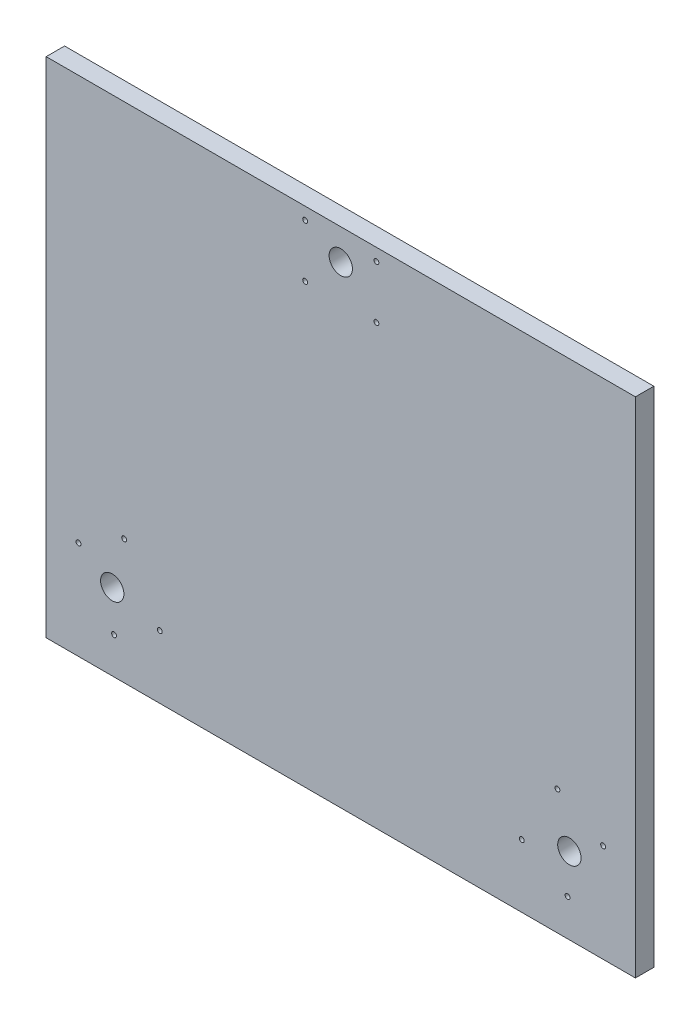
ISO-10303-21;
HEADER;
FILE_DESCRIPTION(('STEP AP214'),'2;1');
FILE_NAME('part.step','',(''),(''),'','','');
FILE_SCHEMA(('AUTOMOTIVE_DESIGN { 1 0 10303 214 1 1 1 1 }'));
ENDSEC;
DATA;
#1=APPLICATION_CONTEXT('core data for automotive mechanical design processes');
#2=APPLICATION_PROTOCOL_DEFINITION('international standard','automotive_design',2000,#1);
#3=PRODUCT_CONTEXT('',#1,'mechanical');
#4=PRODUCT('Part','Part','',(#3));
#5=PRODUCT_RELATED_PRODUCT_CATEGORY('part','',(#4));
#6=PRODUCT_DEFINITION_FORMATION('','',#4);
#7=PRODUCT_DEFINITION_CONTEXT('part definition',#1,'design');
#8=PRODUCT_DEFINITION('design','',#6,#7);
#9=PRODUCT_DEFINITION_SHAPE('','',#8);
#10=(LENGTH_UNIT() NAMED_UNIT(*) SI_UNIT(.MILLI.,.METRE.));
#11=(NAMED_UNIT(*) PLANE_ANGLE_UNIT() SI_UNIT($,.RADIAN.));
#12=(NAMED_UNIT(*) SI_UNIT($,.STERADIAN.) SOLID_ANGLE_UNIT());
#13=UNCERTAINTY_MEASURE_WITH_UNIT(LENGTH_MEASURE(1.E-05),#10,'distance_accuracy_value','');
#14=(GEOMETRIC_REPRESENTATION_CONTEXT(3) GLOBAL_UNCERTAINTY_ASSIGNED_CONTEXT((#13)) GLOBAL_UNIT_ASSIGNED_CONTEXT((#10,
#11,#12)) REPRESENTATION_CONTEXT('',''));
#15=CARTESIAN_POINT('',(0.,0.,0.));
#16=DIRECTION('',(0.,0.,1.));
#17=DIRECTION('',(1.,0.,0.));
#18=AXIS2_PLACEMENT_3D('',#15,#16,#17);
#19=CARTESIAN_POINT('',(0.,0.,15.));
#20=DIRECTION('',(0.,0.,-1.));
#21=DIRECTION('',(-1.,0.,0.));
#22=AXIS2_PLACEMENT_3D('',#19,#20,#21);
#23=PLANE('',#22);
#24=CARTESIAN_POINT('',(147.446750507691,-118.614736709748,15.));
#25=DIRECTION('',(0.,0.,1.));
#26=DIRECTION('',(-0.866025403784442,0.499999999999995,0.));
#27=AXIS2_PLACEMENT_3D('',#24,#25,#26);
#28=CIRCLE('',#27,2.);
#29=CARTESIAN_POINT('',(145.714699700122,-117.614736709748,15.));
#30=VERTEX_POINT('',#29);
#31=EDGE_CURVE('E224',#30,#30,#28,.T.);
#32=ORIENTED_EDGE('',*,*,#31,.F.);
#33=EDGE_LOOP('',(#32));
#34=FACE_BOUND('',#33,.T.);
#35=CARTESIAN_POINT('',(184.685842870422,-140.114736709748,15.));
#36=DIRECTION('',(0.,0.,1.));
#37=DIRECTION('',(-0.866025403784442,0.499999999999995,0.));
#38=AXIS2_PLACEMENT_3D('',#35,#36,#37);
#39=CIRCLE('',#38,2.);
#40=CARTESIAN_POINT('',(182.953792062853,-139.114736709748,15.));
#41=VERTEX_POINT('',#40);
#42=EDGE_CURVE('E218',#41,#41,#39,.T.);
#43=ORIENTED_EDGE('',*,*,#42,.F.);
#44=EDGE_LOOP('',(#43));
#45=FACE_BOUND('',#44,.T.);
#46=CARTESIAN_POINT('',(186.195461813655,-107.499999999999,15.));
#47=DIRECTION('',(0.,0.,1.));
#48=DIRECTION('',(-0.866025403784442,0.499999999999995,0.));
#49=AXIS2_PLACEMENT_3D('',#46,#47,#48);
#50=CIRCLE('',#49,9.50000000000001);
#51=CARTESIAN_POINT('',(177.968220477703,-102.749999999999,15.));
#52=VERTEX_POINT('',#51);
#53=EDGE_CURVE('E209',#52,#52,#50,.T.);
#54=ORIENTED_EDGE('',*,*,#53,.F.);
#55=EDGE_LOOP('',(#54));
#56=FACE_BOUND('',#55,.T.);
#57=CARTESIAN_POINT('',(176.44675050769,-68.3852632902502,15.));
#58=DIRECTION('',(0.,0.,-1.));
#59=DIRECTION('',(0.866025403784442,-0.499999999999995,0.));
#60=AXIS2_PLACEMENT_3D('',#57,#58,#59);
#61=CIRCLE('',#60,2.);
#62=CARTESIAN_POINT('',(178.178801315259,-69.3852632902502,15.));
#63=VERTEX_POINT('',#62);
#64=EDGE_CURVE('E196',#63,#63,#61,.T.);
#65=ORIENTED_EDGE('',*,*,#64,.T.);
#66=EDGE_LOOP('',(#65));
#67=FACE_BOUND('',#66,.T.);
#68=CARTESIAN_POINT('',(-176.44675050769,-68.3852632902515,15.));
#69=DIRECTION('',(0.,0.,1.));
#70=DIRECTION('',(0.866025403784438,0.500000000000001,0.));
#71=AXIS2_PLACEMENT_3D('',#68,#69,#70);
#72=CIRCLE('',#71,2.);
#73=CARTESIAN_POINT('',(-174.714699700121,-67.3852632902515,15.));
#74=VERTEX_POINT('',#73);
#75=EDGE_CURVE('E190',#74,#74,#72,.T.);
#76=ORIENTED_EDGE('',*,*,#75,.F.);
#77=EDGE_LOOP('',(#76));
#78=FACE_BOUND('',#77,.T.);
#79=CARTESIAN_POINT('',(-213.685842870421,-89.8852632902515,15.));
#80=DIRECTION('',(0.,0.,1.));
#81=DIRECTION('',(0.866025403784438,0.500000000000001,0.));
#82=AXIS2_PLACEMENT_3D('',#79,#80,#81);
#83=CIRCLE('',#82,2.);
#84=CARTESIAN_POINT('',(-211.953792062852,-88.8852632902515,15.));
#85=VERTEX_POINT('',#84);
#86=EDGE_CURVE('E180',#85,#85,#83,.T.);
#87=ORIENTED_EDGE('',*,*,#86,.F.);
#88=EDGE_LOOP('',(#87));
#89=FACE_BOUND('',#88,.T.);
#90=CARTESIAN_POINT('',(-186.195461813654,-107.5,15.));
#91=DIRECTION('',(0.,0.,1.));
#92=DIRECTION('',(0.866025403784438,0.500000000000001,0.));
#93=AXIS2_PLACEMENT_3D('',#90,#91,#92);
#94=CIRCLE('',#93,9.50000000000001);
#95=CARTESIAN_POINT('',(-177.968220477702,-102.75,15.));
#96=VERTEX_POINT('',#95);
#97=EDGE_CURVE('E173',#96,#96,#94,.T.);
#98=ORIENTED_EDGE('',*,*,#97,.F.);
#99=EDGE_LOOP('',(#98));
#100=FACE_BOUND('',#99,.T.);
#101=CARTESIAN_POINT('',(-147.44675050769,-118.614736709749,15.));
#102=DIRECTION('',(0.,0.,-1.));
#103=DIRECTION('',(-0.866025403784438,-0.500000000000001,0.));
#104=AXIS2_PLACEMENT_3D('',#101,#102,#103);
#105=CIRCLE('',#104,2.);
#106=CARTESIAN_POINT('',(-149.178801315259,-119.614736709749,15.));
#107=VERTEX_POINT('',#106);
#108=EDGE_CURVE('E161',#107,#107,#105,.T.);
#109=ORIENTED_EDGE('',*,*,#108,.T.);
#110=EDGE_LOOP('',(#109));
#111=FACE_BOUND('',#110,.T.);
#112=CARTESIAN_POINT('',(29.0000000000006,187.,15.));
#113=DIRECTION('',(0.,0.,1.));
#114=DIRECTION('',(0.,-1.,0.));
#115=AXIS2_PLACEMENT_3D('',#112,#113,#114);
#116=CIRCLE('',#115,2.);
#117=CARTESIAN_POINT('',(29.0000000000006,185.,15.));
#118=VERTEX_POINT('',#117);
#119=EDGE_CURVE('E151',#118,#118,#116,.T.);
#120=ORIENTED_EDGE('',*,*,#119,.F.);
#121=EDGE_LOOP('',(#120));
#122=FACE_BOUND('',#121,.T.);
#123=CARTESIAN_POINT('',(29.0000000000008,230.,15.));
#124=DIRECTION('',(0.,0.,1.));
#125=DIRECTION('',(0.,-1.,0.));
#126=AXIS2_PLACEMENT_3D('',#123,#124,#125);
#127=CIRCLE('',#126,2.);
#128=CARTESIAN_POINT('',(29.0000000000008,228.,15.));
#129=VERTEX_POINT('',#128);
#130=EDGE_CURVE('E144',#129,#129,#127,.T.);
#131=ORIENTED_EDGE('',*,*,#130,.F.);
#132=EDGE_LOOP('',(#131));
#133=FACE_BOUND('',#132,.T.);
#134=CARTESIAN_POINT('',(7.24338581669606E-13,215.,15.));
#135=DIRECTION('',(0.,0.,1.));
#136=DIRECTION('',(0.,-1.,0.));
#137=AXIS2_PLACEMENT_3D('',#134,#135,#136);
#138=CIRCLE('',#137,9.50000000000001);
#139=CARTESIAN_POINT('',(6.91169508950596E-13,205.5,15.));
#140=VERTEX_POINT('',#139);
#141=EDGE_CURVE('E138',#140,#140,#138,.T.);
#142=ORIENTED_EDGE('',*,*,#141,.F.);
#143=EDGE_LOOP('',(#142));
#144=FACE_BOUND('',#143,.T.);
#145=CARTESIAN_POINT('',(-28.9999999999994,187.,15.));
#146=DIRECTION('',(0.,0.,-1.));
#147=DIRECTION('',(0.,1.,0.));
#148=AXIS2_PLACEMENT_3D('',#145,#146,#147);
#149=CIRCLE('',#148,2.);
#150=CARTESIAN_POINT('',(-28.9999999999994,189.,15.));
#151=VERTEX_POINT('',#150);
#152=EDGE_CURVE('E129',#151,#151,#149,.T.);
#153=ORIENTED_EDGE('',*,*,#152,.T.);
#154=EDGE_LOOP('',(#153));
#155=FACE_BOUND('',#154,.T.);
#156=DIRECTION('',(0.,1.,0.));
#157=VECTOR('',#156,1.);
#158=CARTESIAN_POINT('',(240.,-170.,15.));
#159=LINE('',#158,#157);
#160=CARTESIAN_POINT('',(240.,-170.,15.));
#161=VERTEX_POINT('',#160);
#162=CARTESIAN_POINT('',(240.,240.,15.));
#163=VERTEX_POINT('',#162);
#164=EDGE_CURVE('E95',#161,#163,#159,.T.);
#165=ORIENTED_EDGE('',*,*,#164,.T.);
#166=DIRECTION('',(-1.,0.,0.));
#167=VECTOR('',#166,1.);
#168=CARTESIAN_POINT('',(-240.,240.,15.));
#169=LINE('',#168,#167);
#170=CARTESIAN_POINT('',(-240.,240.,15.));
#171=VERTEX_POINT('',#170);
#172=EDGE_CURVE('E90',#163,#171,#169,.T.);
#173=ORIENTED_EDGE('',*,*,#172,.T.);
#174=DIRECTION('',(0.,-1.,0.));
#175=VECTOR('',#174,1.);
#176=CARTESIAN_POINT('',(-240.,-170.,15.));
#177=LINE('',#176,#175);
#178=CARTESIAN_POINT('',(-240.,-170.,15.));
#179=VERTEX_POINT('',#178);
#180=EDGE_CURVE('E93',#171,#179,#177,.T.);
#181=ORIENTED_EDGE('',*,*,#180,.T.);
#182=DIRECTION('',(1.,0.,0.));
#183=VECTOR('',#182,1.);
#184=CARTESIAN_POINT('',(-240.,-170.,15.));
#185=LINE('',#184,#183);
#186=EDGE_CURVE('E60',#179,#161,#185,.T.);
#187=ORIENTED_EDGE('',*,*,#186,.T.);
#188=EDGE_LOOP('',(#165,#173,#181,#187));
#189=FACE_BOUND('',#188,.T.);
#190=CARTESIAN_POINT('',(-28.9999999999992,230.,15.));
#191=DIRECTION('',(0.,0.,-1.));
#192=DIRECTION('',(0.,1.,0.));
#193=AXIS2_PLACEMENT_3D('',#190,#191,#192);
#194=CIRCLE('',#193,2.);
#195=CARTESIAN_POINT('',(-28.9999999999992,232.,15.));
#196=VERTEX_POINT('',#195);
#197=EDGE_CURVE('E117',#196,#196,#194,.T.);
#198=ORIENTED_EDGE('',*,*,#197,.T.);
#199=EDGE_LOOP('',(#198));
#200=FACE_BOUND('',#199,.T.);
#201=CARTESIAN_POINT('',(-184.685842870421,-140.114736709749,15.));
#202=DIRECTION('',(0.,0.,-1.));
#203=DIRECTION('',(-0.866025403784438,-0.500000000000001,0.));
#204=AXIS2_PLACEMENT_3D('',#201,#202,#203);
#205=CIRCLE('',#204,2.);
#206=CARTESIAN_POINT('',(-186.41789367799,-141.114736709749,15.));
#207=VERTEX_POINT('',#206);
#208=EDGE_CURVE('E167',#207,#207,#205,.T.);
#209=ORIENTED_EDGE('',*,*,#208,.T.);
#210=EDGE_LOOP('',(#209));
#211=FACE_BOUND('',#210,.T.);
#212=CARTESIAN_POINT('',(213.685842870421,-89.88526329025,15.));
#213=DIRECTION('',(0.,0.,-1.));
#214=DIRECTION('',(0.866025403784442,-0.499999999999995,0.));
#215=AXIS2_PLACEMENT_3D('',#212,#213,#214);
#216=CIRCLE('',#215,2.);
#217=CARTESIAN_POINT('',(215.41789367799,-90.88526329025,15.));
#218=VERTEX_POINT('',#217);
#219=EDGE_CURVE('E202',#218,#218,#216,.T.);
#220=ORIENTED_EDGE('',*,*,#219,.T.);
#221=EDGE_LOOP('',(#220));
#222=FACE_BOUND('',#221,.T.);
#223=ADVANCED_FACE('F43',(#34,#45,#56,#67,#78,#89,#100,#111,#122,#133,#144,#155,#189,#200,#211,
#222),#23,.F.);
#224=CARTESIAN_POINT('',(0.,0.,0.));
#225=DIRECTION('',(0.,0.,-1.));
#226=DIRECTION('',(-1.,0.,0.));
#227=AXIS2_PLACEMENT_3D('',#224,#225,#226);
#228=PLANE('',#227);
#229=CARTESIAN_POINT('',(147.446750507691,-118.614736709748,0.));
#230=DIRECTION('',(0.,0.,1.));
#231=DIRECTION('',(-0.866025403784442,0.499999999999995,0.));
#232=AXIS2_PLACEMENT_3D('',#229,#230,#231);
#233=CIRCLE('',#232,2.);
#234=CARTESIAN_POINT('',(145.714699700122,-117.614736709748,0.));
#235=VERTEX_POINT('',#234);
#236=EDGE_CURVE('E222',#235,#235,#233,.T.);
#237=ORIENTED_EDGE('',*,*,#236,.T.);
#238=EDGE_LOOP('',(#237));
#239=FACE_BOUND('',#238,.T.);
#240=CARTESIAN_POINT('',(184.685842870422,-140.114736709748,0.));
#241=DIRECTION('',(0.,0.,1.));
#242=DIRECTION('',(-0.866025403784442,0.499999999999995,0.));
#243=AXIS2_PLACEMENT_3D('',#240,#241,#242);
#244=CIRCLE('',#243,2.);
#245=CARTESIAN_POINT('',(182.953792062853,-139.114736709748,0.));
#246=VERTEX_POINT('',#245);
#247=EDGE_CURVE('E213',#246,#246,#244,.T.);
#248=ORIENTED_EDGE('',*,*,#247,.T.);
#249=EDGE_LOOP('',(#248));
#250=FACE_BOUND('',#249,.T.);
#251=CARTESIAN_POINT('',(186.195461813655,-107.499999999999,0.));
#252=DIRECTION('',(0.,0.,1.));
#253=DIRECTION('',(-0.866025403784442,0.499999999999995,0.));
#254=AXIS2_PLACEMENT_3D('',#251,#252,#253);
#255=CIRCLE('',#254,9.50000000000001);
#256=CARTESIAN_POINT('',(177.968220477703,-102.749999999999,0.));
#257=VERTEX_POINT('',#256);
#258=EDGE_CURVE('E206',#257,#257,#255,.T.);
#259=ORIENTED_EDGE('',*,*,#258,.T.);
#260=EDGE_LOOP('',(#259));
#261=FACE_BOUND('',#260,.T.);
#262=CARTESIAN_POINT('',(176.44675050769,-68.3852632902502,0.));
#263=DIRECTION('',(0.,0.,-1.));
#264=DIRECTION('',(0.866025403784442,-0.499999999999995,0.));
#265=AXIS2_PLACEMENT_3D('',#262,#263,#264);
#266=CIRCLE('',#265,2.);
#267=CARTESIAN_POINT('',(178.178801315259,-69.3852632902502,0.));
#268=VERTEX_POINT('',#267);
#269=EDGE_CURVE('E194',#268,#268,#266,.T.);
#270=ORIENTED_EDGE('',*,*,#269,.F.);
#271=EDGE_LOOP('',(#270));
#272=FACE_BOUND('',#271,.T.);
#273=CARTESIAN_POINT('',(-176.44675050769,-68.3852632902515,0.));
#274=DIRECTION('',(0.,0.,1.));
#275=DIRECTION('',(0.866025403784438,0.500000000000001,0.));
#276=AXIS2_PLACEMENT_3D('',#273,#274,#275);
#277=CIRCLE('',#276,2.);
#278=CARTESIAN_POINT('',(-174.714699700121,-67.3852632902515,0.));
#279=VERTEX_POINT('',#278);
#280=EDGE_CURVE('E184',#279,#279,#277,.T.);
#281=ORIENTED_EDGE('',*,*,#280,.T.);
#282=EDGE_LOOP('',(#281));
#283=FACE_BOUND('',#282,.T.);
#284=CARTESIAN_POINT('',(-213.685842870421,-89.8852632902515,0.));
#285=DIRECTION('',(0.,0.,1.));
#286=DIRECTION('',(0.866025403784438,0.500000000000001,0.));
#287=AXIS2_PLACEMENT_3D('',#284,#285,#286);
#288=CIRCLE('',#287,2.);
#289=CARTESIAN_POINT('',(-211.953792062852,-88.8852632902515,0.));
#290=VERTEX_POINT('',#289);
#291=EDGE_CURVE('E177',#290,#290,#288,.T.);
#292=ORIENTED_EDGE('',*,*,#291,.T.);
#293=EDGE_LOOP('',(#292));
#294=FACE_BOUND('',#293,.T.);
#295=CARTESIAN_POINT('',(-186.195461813654,-107.5,0.));
#296=DIRECTION('',(0.,0.,1.));
#297=DIRECTION('',(0.866025403784438,0.500000000000001,0.));
#298=AXIS2_PLACEMENT_3D('',#295,#296,#297);
#299=CIRCLE('',#298,9.50000000000001);
#300=CARTESIAN_POINT('',(-177.968220477702,-102.75,0.));
#301=VERTEX_POINT('',#300);
#302=EDGE_CURVE('E171',#301,#301,#299,.T.);
#303=ORIENTED_EDGE('',*,*,#302,.T.);
#304=EDGE_LOOP('',(#303));
#305=FACE_BOUND('',#304,.T.);
#306=CARTESIAN_POINT('',(-147.44675050769,-118.614736709749,0.));
#307=DIRECTION('',(0.,0.,-1.));
#308=DIRECTION('',(-0.866025403784438,-0.500000000000001,0.));
#309=AXIS2_PLACEMENT_3D('',#306,#307,#308);
#310=CIRCLE('',#309,2.);
#311=CARTESIAN_POINT('',(-149.178801315259,-119.614736709749,0.));
#312=VERTEX_POINT('',#311);
#313=EDGE_CURVE('E155',#312,#312,#310,.T.);
#314=ORIENTED_EDGE('',*,*,#313,.F.);
#315=EDGE_LOOP('',(#314));
#316=FACE_BOUND('',#315,.T.);
#317=CARTESIAN_POINT('',(29.0000000000006,187.,0.));
#318=DIRECTION('',(0.,0.,1.));
#319=DIRECTION('',(0.,-1.,0.));
#320=AXIS2_PLACEMENT_3D('',#317,#318,#319);
#321=CIRCLE('',#320,2.);
#322=CARTESIAN_POINT('',(29.0000000000006,185.,0.));
#323=VERTEX_POINT('',#322);
#324=EDGE_CURVE('E148',#323,#323,#321,.T.);
#325=ORIENTED_EDGE('',*,*,#324,.T.);
#326=EDGE_LOOP('',(#325));
#327=FACE_BOUND('',#326,.T.);
#328=CARTESIAN_POINT('',(29.0000000000008,230.,0.));
#329=DIRECTION('',(0.,0.,1.));
#330=DIRECTION('',(0.,-1.,0.));
#331=AXIS2_PLACEMENT_3D('',#328,#329,#330);
#332=CIRCLE('',#331,2.);
#333=CARTESIAN_POINT('',(29.0000000000008,228.,0.));
#334=VERTEX_POINT('',#333);
#335=EDGE_CURVE('E142',#334,#334,#332,.T.);
#336=ORIENTED_EDGE('',*,*,#335,.T.);
#337=EDGE_LOOP('',(#336));
#338=FACE_BOUND('',#337,.T.);
#339=CARTESIAN_POINT('',(7.24338581669606E-13,215.,0.));
#340=DIRECTION('',(0.,0.,1.));
#341=DIRECTION('',(0.,-1.,0.));
#342=AXIS2_PLACEMENT_3D('',#339,#340,#341);
#343=CIRCLE('',#342,9.50000000000001);
#344=CARTESIAN_POINT('',(6.91169508950596E-13,205.5,0.));
#345=VERTEX_POINT('',#344);
#346=EDGE_CURVE('E123',#345,#345,#343,.T.);
#347=ORIENTED_EDGE('',*,*,#346,.T.);
#348=EDGE_LOOP('',(#347));
#349=FACE_BOUND('',#348,.T.);
#350=CARTESIAN_POINT('',(-28.9999999999994,187.,0.));
#351=DIRECTION('',(0.,0.,-1.));
#352=DIRECTION('',(0.,1.,0.));
#353=AXIS2_PLACEMENT_3D('',#350,#351,#352);
#354=CIRCLE('',#353,2.);
#355=CARTESIAN_POINT('',(-28.9999999999994,189.,0.));
#356=VERTEX_POINT('',#355);
#357=EDGE_CURVE('E125',#356,#356,#354,.T.);
#358=ORIENTED_EDGE('',*,*,#357,.F.);
#359=EDGE_LOOP('',(#358));
#360=FACE_BOUND('',#359,.T.);
#361=DIRECTION('',(0.,1.,0.));
#362=VECTOR('',#361,1.);
#363=CARTESIAN_POINT('',(240.,-170.,0.));
#364=LINE('',#363,#362);
#365=CARTESIAN_POINT('',(240.,-170.,0.));
#366=VERTEX_POINT('',#365);
#367=CARTESIAN_POINT('',(240.,240.,0.));
#368=VERTEX_POINT('',#367);
#369=EDGE_CURVE('E128',#366,#368,#364,.T.);
#370=ORIENTED_EDGE('',*,*,#369,.F.);
#371=DIRECTION('',(1.,0.,0.));
#372=VECTOR('',#371,1.);
#373=CARTESIAN_POINT('',(-240.,-170.,0.));
#374=LINE('',#373,#372);
#375=CARTESIAN_POINT('',(-240.,-170.,0.));
#376=VERTEX_POINT('',#375);
#377=EDGE_CURVE('E83',#376,#366,#374,.T.);
#378=ORIENTED_EDGE('',*,*,#377,.F.);
#379=DIRECTION('',(0.,-1.,0.));
#380=VECTOR('',#379,1.);
#381=CARTESIAN_POINT('',(-240.,-170.,0.));
#382=LINE('',#381,#380);
#383=CARTESIAN_POINT('',(-240.,240.,0.));
#384=VERTEX_POINT('',#383);
#385=EDGE_CURVE('E77',#384,#376,#382,.T.);
#386=ORIENTED_EDGE('',*,*,#385,.F.);
#387=DIRECTION('',(-1.,0.,0.));
#388=VECTOR('',#387,1.);
#389=CARTESIAN_POINT('',(-240.,240.,0.));
#390=LINE('',#389,#388);
#391=EDGE_CURVE('E99',#368,#384,#390,.T.);
#392=ORIENTED_EDGE('',*,*,#391,.F.);
#393=EDGE_LOOP('',(#370,#378,#386,#392));
#394=FACE_BOUND('',#393,.T.);
#395=CARTESIAN_POINT('',(-28.9999999999992,230.,0.));
#396=DIRECTION('',(0.,0.,-1.));
#397=DIRECTION('',(0.,1.,0.));
#398=AXIS2_PLACEMENT_3D('',#395,#396,#397);
#399=CIRCLE('',#398,2.);
#400=CARTESIAN_POINT('',(-28.9999999999992,232.,0.));
#401=VERTEX_POINT('',#400);
#402=EDGE_CURVE('E122',#401,#401,#399,.T.);
#403=ORIENTED_EDGE('',*,*,#402,.F.);
#404=EDGE_LOOP('',(#403));
#405=FACE_BOUND('',#404,.T.);
#406=CARTESIAN_POINT('',(-184.685842870421,-140.114736709749,0.));
#407=DIRECTION('',(0.,0.,-1.));
#408=DIRECTION('',(-0.866025403784438,-0.500000000000001,0.));
#409=AXIS2_PLACEMENT_3D('',#406,#407,#408);
#410=CIRCLE('',#409,2.);
#411=CARTESIAN_POINT('',(-186.41789367799,-141.114736709749,0.));
#412=VERTEX_POINT('',#411);
#413=EDGE_CURVE('E165',#412,#412,#410,.T.);
#414=ORIENTED_EDGE('',*,*,#413,.F.);
#415=EDGE_LOOP('',(#414));
#416=FACE_BOUND('',#415,.T.);
#417=CARTESIAN_POINT('',(213.685842870421,-89.88526329025,0.));
#418=DIRECTION('',(0.,0.,-1.));
#419=DIRECTION('',(0.866025403784442,-0.499999999999995,0.));
#420=AXIS2_PLACEMENT_3D('',#417,#418,#419);
#421=CIRCLE('',#420,2.);
#422=CARTESIAN_POINT('',(215.41789367799,-90.88526329025,0.));
#423=VERTEX_POINT('',#422);
#424=EDGE_CURVE('E200',#423,#423,#421,.T.);
#425=ORIENTED_EDGE('',*,*,#424,.F.);
#426=EDGE_LOOP('',(#425));
#427=FACE_BOUND('',#426,.T.);
#428=ADVANCED_FACE('F231',(#239,#250,#261,#272,#283,#294,#305,#316,#327,#338,#349,#360,#394,
#405,#416,#427),#228,.T.);
#429=CARTESIAN_POINT('',(240.,-170.,15.));
#430=DIRECTION('',(-1.,0.,0.));
#431=DIRECTION('',(0.,-1.,0.));
#432=AXIS2_PLACEMENT_3D('',#429,#430,#431);
#433=PLANE('',#432);
#434=ORIENTED_EDGE('',*,*,#369,.T.);
#435=DIRECTION('',(0.,0.,-1.));
#436=VECTOR('',#435,1.);
#437=CARTESIAN_POINT('',(240.,240.,15.));
#438=LINE('',#437,#436);
#439=EDGE_CURVE('E12',#163,#368,#438,.T.);
#440=ORIENTED_EDGE('',*,*,#439,.F.);
#441=ORIENTED_EDGE('',*,*,#164,.F.);
#442=DIRECTION('',(0.,0.,-1.));
#443=VECTOR('',#442,1.);
#444=CARTESIAN_POINT('',(240.,-170.,15.));
#445=LINE('',#444,#443);
#446=EDGE_CURVE('E103',#161,#366,#445,.T.);
#447=ORIENTED_EDGE('',*,*,#446,.T.);
#448=EDGE_LOOP('',(#434,#440,#441,#447));
#449=FACE_BOUND('',#448,.T.);
#450=ADVANCED_FACE('F45',(#449),#433,.F.);
#451=CARTESIAN_POINT('',(-240.,240.,15.));
#452=DIRECTION('',(0.,-1.,0.));
#453=DIRECTION('',(1.,0.,0.));
#454=AXIS2_PLACEMENT_3D('',#451,#452,#453);
#455=PLANE('',#454);
#456=ORIENTED_EDGE('',*,*,#391,.T.);
#457=DIRECTION('',(0.,0.,-1.));
#458=VECTOR('',#457,1.);
#459=CARTESIAN_POINT('',(-240.,240.,15.));
#460=LINE('',#459,#458);
#461=EDGE_CURVE('E52',#171,#384,#460,.T.);
#462=ORIENTED_EDGE('',*,*,#461,.F.);
#463=ORIENTED_EDGE('',*,*,#172,.F.);
#464=ORIENTED_EDGE('',*,*,#439,.T.);
#465=EDGE_LOOP('',(#456,#462,#463,#464));
#466=FACE_BOUND('',#465,.T.);
#467=ADVANCED_FACE('F98',(#466),#455,.F.);
#468=CARTESIAN_POINT('',(-240.,-170.,15.));
#469=DIRECTION('',(1.,0.,0.));
#470=DIRECTION('',(0.,0.,-1.));
#471=AXIS2_PLACEMENT_3D('',#468,#469,#470);
#472=PLANE('',#471);
#473=ORIENTED_EDGE('',*,*,#385,.T.);
#474=DIRECTION('',(0.,0.,-1.));
#475=VECTOR('',#474,1.);
#476=CARTESIAN_POINT('',(-240.,-170.,15.));
#477=LINE('',#476,#475);
#478=EDGE_CURVE('E100',#179,#376,#477,.T.);
#479=ORIENTED_EDGE('',*,*,#478,.F.);
#480=ORIENTED_EDGE('',*,*,#180,.F.);
#481=ORIENTED_EDGE('',*,*,#461,.T.);
#482=EDGE_LOOP('',(#473,#479,#480,#481));
#483=FACE_BOUND('',#482,.T.);
#484=ADVANCED_FACE('F101',(#483),#472,.F.);
#485=CARTESIAN_POINT('',(-240.,-170.,15.));
#486=DIRECTION('',(0.,1.,0.));
#487=DIRECTION('',(-1.,0.,0.));
#488=AXIS2_PLACEMENT_3D('',#485,#486,#487);
#489=PLANE('',#488);
#490=ORIENTED_EDGE('',*,*,#377,.T.);
#491=ORIENTED_EDGE('',*,*,#446,.F.);
#492=ORIENTED_EDGE('',*,*,#186,.F.);
#493=ORIENTED_EDGE('',*,*,#478,.T.);
#494=EDGE_LOOP('',(#490,#491,#492,#493));
#495=FACE_BOUND('',#494,.T.);
#496=ADVANCED_FACE('F269',(#495),#489,.F.);
#497=CARTESIAN_POINT('',(-28.9999999999994,187.,0.));
#498=DIRECTION('',(0.,0.,1.));
#499=DIRECTION('',(1.,0.,0.));
#500=AXIS2_PLACEMENT_3D('',#497,#498,#499);
#501=CYLINDRICAL_SURFACE('',#500,2.);
#502=ORIENTED_EDGE('',*,*,#357,.T.);
#503=EDGE_LOOP('',(#502));
#504=FACE_BOUND('',#503,.T.);
#505=ORIENTED_EDGE('',*,*,#152,.F.);
#506=EDGE_LOOP('',(#505));
#507=FACE_BOUND('',#506,.T.);
#508=ADVANCED_FACE('F266',(#504,#507),#501,.F.);
#509=CARTESIAN_POINT('',(-28.9999999999992,230.,0.));
#510=DIRECTION('',(0.,0.,1.));
#511=DIRECTION('',(1.,0.,0.));
#512=AXIS2_PLACEMENT_3D('',#509,#510,#511);
#513=CYLINDRICAL_SURFACE('',#512,2.);
#514=ORIENTED_EDGE('',*,*,#402,.T.);
#515=EDGE_LOOP('',(#514));
#516=FACE_BOUND('',#515,.T.);
#517=ORIENTED_EDGE('',*,*,#197,.F.);
#518=EDGE_LOOP('',(#517));
#519=FACE_BOUND('',#518,.T.);
#520=ADVANCED_FACE('F268',(#516,#519),#513,.F.);
#521=CARTESIAN_POINT('',(7.24338581669606E-13,215.,0.));
#522=DIRECTION('',(0.,0.,1.));
#523=DIRECTION('',(1.,0.,0.));
#524=AXIS2_PLACEMENT_3D('',#521,#522,#523);
#525=CYLINDRICAL_SURFACE('',#524,9.50000000000001);
#526=ORIENTED_EDGE('',*,*,#346,.F.);
#527=EDGE_LOOP('',(#526));
#528=FACE_BOUND('',#527,.T.);
#529=ORIENTED_EDGE('',*,*,#141,.T.);
#530=EDGE_LOOP('',(#529));
#531=FACE_BOUND('',#530,.T.);
#532=ADVANCED_FACE('F276',(#528,#531),#525,.F.);
#533=CARTESIAN_POINT('',(29.0000000000008,230.,0.));
#534=DIRECTION('',(0.,0.,1.));
#535=DIRECTION('',(1.,0.,0.));
#536=AXIS2_PLACEMENT_3D('',#533,#534,#535);
#537=CYLINDRICAL_SURFACE('',#536,2.);
#538=ORIENTED_EDGE('',*,*,#335,.F.);
#539=EDGE_LOOP('',(#538));
#540=FACE_BOUND('',#539,.T.);
#541=ORIENTED_EDGE('',*,*,#130,.T.);
#542=EDGE_LOOP('',(#541));
#543=FACE_BOUND('',#542,.T.);
#544=ADVANCED_FACE('F349',(#540,#543),#537,.F.);
#545=CARTESIAN_POINT('',(29.0000000000006,187.,0.));
#546=DIRECTION('',(0.,0.,1.));
#547=DIRECTION('',(1.,0.,0.));
#548=AXIS2_PLACEMENT_3D('',#545,#546,#547);
#549=CYLINDRICAL_SURFACE('',#548,2.);
#550=ORIENTED_EDGE('',*,*,#324,.F.);
#551=EDGE_LOOP('',(#550));
#552=FACE_BOUND('',#551,.T.);
#553=ORIENTED_EDGE('',*,*,#119,.T.);
#554=EDGE_LOOP('',(#553));
#555=FACE_BOUND('',#554,.T.);
#556=ADVANCED_FACE('F345',(#552,#555),#549,.F.);
#557=CARTESIAN_POINT('',(-147.44675050769,-118.614736709749,0.));
#558=DIRECTION('',(0.,0.,1.));
#559=DIRECTION('',(1.,0.,0.));
#560=AXIS2_PLACEMENT_3D('',#557,#558,#559);
#561=CYLINDRICAL_SURFACE('',#560,2.);
#562=ORIENTED_EDGE('',*,*,#313,.T.);
#563=EDGE_LOOP('',(#562));
#564=FACE_BOUND('',#563,.T.);
#565=ORIENTED_EDGE('',*,*,#108,.F.);
#566=EDGE_LOOP('',(#565));
#567=FACE_BOUND('',#566,.T.);
#568=ADVANCED_FACE('F341',(#564,#567),#561,.F.);
#569=CARTESIAN_POINT('',(-184.685842870421,-140.114736709749,0.));
#570=DIRECTION('',(0.,0.,1.));
#571=DIRECTION('',(1.,0.,0.));
#572=AXIS2_PLACEMENT_3D('',#569,#570,#571);
#573=CYLINDRICAL_SURFACE('',#572,2.);
#574=ORIENTED_EDGE('',*,*,#413,.T.);
#575=EDGE_LOOP('',(#574));
#576=FACE_BOUND('',#575,.T.);
#577=ORIENTED_EDGE('',*,*,#208,.F.);
#578=EDGE_LOOP('',(#577));
#579=FACE_BOUND('',#578,.T.);
#580=ADVANCED_FACE('F337',(#576,#579),#573,.F.);
#581=CARTESIAN_POINT('',(-186.195461813654,-107.5,0.));
#582=DIRECTION('',(0.,0.,1.));
#583=DIRECTION('',(1.,0.,0.));
#584=AXIS2_PLACEMENT_3D('',#581,#582,#583);
#585=CYLINDRICAL_SURFACE('',#584,9.50000000000001);
#586=ORIENTED_EDGE('',*,*,#302,.F.);
#587=EDGE_LOOP('',(#586));
#588=FACE_BOUND('',#587,.T.);
#589=ORIENTED_EDGE('',*,*,#97,.T.);
#590=EDGE_LOOP('',(#589));
#591=FACE_BOUND('',#590,.T.);
#592=ADVANCED_FACE('F333',(#588,#591),#585,.F.);
#593=CARTESIAN_POINT('',(-213.685842870421,-89.8852632902515,0.));
#594=DIRECTION('',(0.,0.,1.));
#595=DIRECTION('',(1.,0.,0.));
#596=AXIS2_PLACEMENT_3D('',#593,#594,#595);
#597=CYLINDRICAL_SURFACE('',#596,2.);
#598=ORIENTED_EDGE('',*,*,#291,.F.);
#599=EDGE_LOOP('',(#598));
#600=FACE_BOUND('',#599,.T.);
#601=ORIENTED_EDGE('',*,*,#86,.T.);
#602=EDGE_LOOP('',(#601));
#603=FACE_BOUND('',#602,.T.);
#604=ADVANCED_FACE('F329',(#600,#603),#597,.F.);
#605=CARTESIAN_POINT('',(-176.44675050769,-68.3852632902515,0.));
#606=DIRECTION('',(0.,0.,1.));
#607=DIRECTION('',(1.,0.,0.));
#608=AXIS2_PLACEMENT_3D('',#605,#606,#607);
#609=CYLINDRICAL_SURFACE('',#608,2.);
#610=ORIENTED_EDGE('',*,*,#280,.F.);
#611=EDGE_LOOP('',(#610));
#612=FACE_BOUND('',#611,.T.);
#613=ORIENTED_EDGE('',*,*,#75,.T.);
#614=EDGE_LOOP('',(#613));
#615=FACE_BOUND('',#614,.T.);
#616=ADVANCED_FACE('F322',(#612,#615),#609,.F.);
#617=CARTESIAN_POINT('',(176.44675050769,-68.3852632902502,0.));
#618=DIRECTION('',(0.,0.,1.));
#619=DIRECTION('',(1.,0.,0.));
#620=AXIS2_PLACEMENT_3D('',#617,#618,#619);
#621=CYLINDRICAL_SURFACE('',#620,2.);
#622=ORIENTED_EDGE('',*,*,#269,.T.);
#623=EDGE_LOOP('',(#622));
#624=FACE_BOUND('',#623,.T.);
#625=ORIENTED_EDGE('',*,*,#64,.F.);
#626=EDGE_LOOP('',(#625));
#627=FACE_BOUND('',#626,.T.);
#628=ADVANCED_FACE('F312',(#624,#627),#621,.F.);
#629=CARTESIAN_POINT('',(213.685842870421,-89.88526329025,0.));
#630=DIRECTION('',(0.,0.,1.));
#631=DIRECTION('',(1.,0.,0.));
#632=AXIS2_PLACEMENT_3D('',#629,#630,#631);
#633=CYLINDRICAL_SURFACE('',#632,2.);
#634=ORIENTED_EDGE('',*,*,#424,.T.);
#635=EDGE_LOOP('',(#634));
#636=FACE_BOUND('',#635,.T.);
#637=ORIENTED_EDGE('',*,*,#219,.F.);
#638=EDGE_LOOP('',(#637));
#639=FACE_BOUND('',#638,.T.);
#640=ADVANCED_FACE('F308',(#636,#639),#633,.F.);
#641=CARTESIAN_POINT('',(186.195461813655,-107.499999999999,0.));
#642=DIRECTION('',(0.,0.,1.));
#643=DIRECTION('',(1.,0.,0.));
#644=AXIS2_PLACEMENT_3D('',#641,#642,#643);
#645=CYLINDRICAL_SURFACE('',#644,9.50000000000001);
#646=ORIENTED_EDGE('',*,*,#258,.F.);
#647=EDGE_LOOP('',(#646));
#648=FACE_BOUND('',#647,.T.);
#649=ORIENTED_EDGE('',*,*,#53,.T.);
#650=EDGE_LOOP('',(#649));
#651=FACE_BOUND('',#650,.T.);
#652=ADVANCED_FACE('F311',(#648,#651),#645,.F.);
#653=CARTESIAN_POINT('',(184.685842870422,-140.114736709748,0.));
#654=DIRECTION('',(0.,0.,1.));
#655=DIRECTION('',(1.,0.,0.));
#656=AXIS2_PLACEMENT_3D('',#653,#654,#655);
#657=CYLINDRICAL_SURFACE('',#656,2.);
#658=ORIENTED_EDGE('',*,*,#247,.F.);
#659=EDGE_LOOP('',(#658));
#660=FACE_BOUND('',#659,.T.);
#661=ORIENTED_EDGE('',*,*,#42,.T.);
#662=EDGE_LOOP('',(#661));
#663=FACE_BOUND('',#662,.T.);
#664=ADVANCED_FACE('F237',(#660,#663),#657,.F.);
#665=CARTESIAN_POINT('',(147.446750507691,-118.614736709748,0.));
#666=DIRECTION('',(0.,0.,1.));
#667=DIRECTION('',(1.,0.,0.));
#668=AXIS2_PLACEMENT_3D('',#665,#666,#667);
#669=CYLINDRICAL_SURFACE('',#668,2.);
#670=ORIENTED_EDGE('',*,*,#236,.F.);
#671=EDGE_LOOP('',(#670));
#672=FACE_BOUND('',#671,.T.);
#673=ORIENTED_EDGE('',*,*,#31,.T.);
#674=EDGE_LOOP('',(#673));
#675=FACE_BOUND('',#674,.T.);
#676=ADVANCED_FACE('F234',(#672,#675),#669,.F.);
#677=CLOSED_SHELL('',(#223,#428,#450,#467,#484,#496,#508,#520,#532,#544,#556,#568,#580,#592,
#604,#616,#628,#640,#652,#664,#676));
#678=MANIFOLD_SOLID_BREP('B2',#677);
#679=ADVANCED_BREP_SHAPE_REPRESENTATION('',(#18,#678),#14);
#680=SHAPE_DEFINITION_REPRESENTATION(#9,#679);
ENDSEC;
END-ISO-10303-21;
